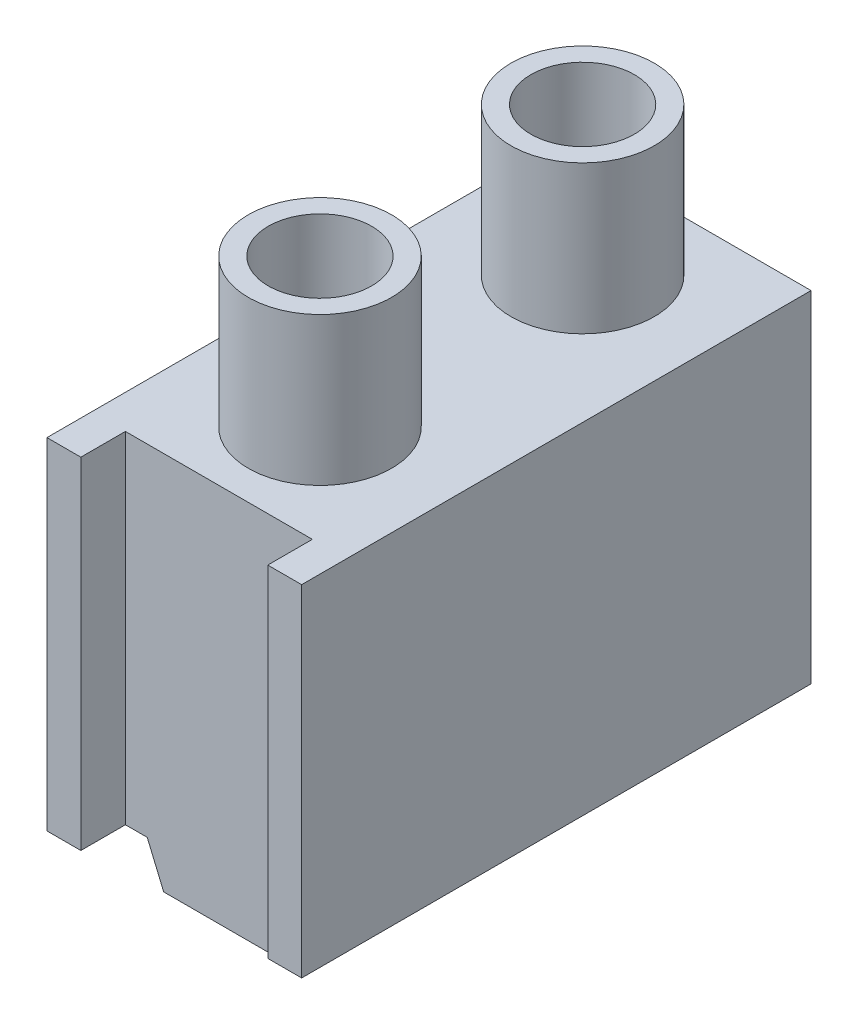
ISO-10303-21;
HEADER;
FILE_DESCRIPTION(('STEP AP214'),'2;1');
FILE_NAME('part.step','',(''),(''),'','','');
FILE_SCHEMA(('AUTOMOTIVE_DESIGN { 1 0 10303 214 1 1 1 1 }'));
ENDSEC;
DATA;
#1=APPLICATION_CONTEXT('core data for automotive mechanical design processes');
#2=APPLICATION_PROTOCOL_DEFINITION('international standard','automotive_design',2000,#1);
#3=PRODUCT_CONTEXT('',#1,'mechanical');
#4=PRODUCT('Part','Part','',(#3));
#5=PRODUCT_RELATED_PRODUCT_CATEGORY('part','',(#4));
#6=PRODUCT_DEFINITION_FORMATION('','',#4);
#7=PRODUCT_DEFINITION_CONTEXT('part definition',#1,'design');
#8=PRODUCT_DEFINITION('design','',#6,#7);
#9=PRODUCT_DEFINITION_SHAPE('','',#8);
#10=(LENGTH_UNIT() NAMED_UNIT(*) SI_UNIT(.MILLI.,.METRE.));
#11=(NAMED_UNIT(*) PLANE_ANGLE_UNIT() SI_UNIT($,.RADIAN.));
#12=(NAMED_UNIT(*) SI_UNIT($,.STERADIAN.) SOLID_ANGLE_UNIT());
#13=UNCERTAINTY_MEASURE_WITH_UNIT(LENGTH_MEASURE(1.E-05),#10,'distance_accuracy_value','');
#14=(GEOMETRIC_REPRESENTATION_CONTEXT(3) GLOBAL_UNCERTAINTY_ASSIGNED_CONTEXT((#13)) GLOBAL_UNIT_ASSIGNED_CONTEXT((#10,
#11,#12)) REPRESENTATION_CONTEXT('',''));
#15=CARTESIAN_POINT('',(0.,0.,0.));
#16=DIRECTION('',(0.,0.,1.));
#17=DIRECTION('',(1.,0.,0.));
#18=AXIS2_PLACEMENT_3D('',#15,#16,#17);
#19=CARTESIAN_POINT('',(0.,0.,32.));
#20=DIRECTION('',(0.,0.,1.));
#21=DIRECTION('',(1.,0.,0.));
#22=AXIS2_PLACEMENT_3D('',#19,#20,#21);
#23=PLANE('',#22);
#24=DIRECTION('',(0.,-1.,0.));
#25=VECTOR('',#24,1.);
#26=CARTESIAN_POINT('',(-13.87111125249,-113.2078554853,32.));
#27=LINE('',#26,#25);
#28=CARTESIAN_POINT('',(-13.87111125249,-113.2078554853,32.));
#29=VERTEX_POINT('',#28);
#30=CARTESIAN_POINT('',(-13.87111125249,-134.6078554853,32.));
#31=VERTEX_POINT('',#30);
#32=EDGE_CURVE('E25',#29,#31,#27,.T.);
#33=ORIENTED_EDGE('',*,*,#32,.F.);
#34=DIRECTION('',(-1.,0.,0.));
#35=VECTOR('',#34,1.);
#36=CARTESIAN_POINT('',(-13.87111125249,-113.2078554853,32.));
#37=LINE('',#36,#35);
#38=CARTESIAN_POINT('',(-16.,-113.2078554853,32.));
#39=VERTEX_POINT('',#38);
#40=EDGE_CURVE('E332',#29,#39,#37,.T.);
#41=ORIENTED_EDGE('',*,*,#40,.T.);
#42=DIRECTION('',(0.,-1.,0.));
#43=VECTOR('',#42,1.);
#44=CARTESIAN_POINT('',(-16.,-113.2078554853,32.));
#45=LINE('',#44,#43);
#46=CARTESIAN_POINT('',(-16.,-134.6078554853,32.));
#47=VERTEX_POINT('',#46);
#48=EDGE_CURVE('E37',#39,#47,#45,.T.);
#49=ORIENTED_EDGE('',*,*,#48,.T.);
#50=DIRECTION('',(1.,0.,0.));
#51=VECTOR('',#50,1.);
#52=CARTESIAN_POINT('',(-16.,-134.6078554853,32.));
#53=LINE('',#52,#51);
#54=EDGE_CURVE('E317',#47,#31,#53,.T.);
#55=ORIENTED_EDGE('',*,*,#54,.T.);
#56=EDGE_LOOP('',(#33,#41,#49,#55));
#57=FACE_BOUND('',#56,.T.);
#58=ADVANCED_FACE('F17',(#57),#23,.T.);
#59=CARTESIAN_POINT('',(0.,0.,32.));
#60=DIRECTION('',(0.,0.,1.));
#61=DIRECTION('',(1.,0.,0.));
#62=AXIS2_PLACEMENT_3D('',#59,#60,#61);
#63=PLANE('',#62);
#64=DIRECTION('',(0.,1.,0.));
#65=VECTOR('',#64,1.);
#66=CARTESIAN_POINT('',(-2.128888747504,-134.6078554853,32.));
#67=LINE('',#66,#65);
#68=CARTESIAN_POINT('',(-2.128888747504,-134.6078554853,32.));
#69=VERTEX_POINT('',#68);
#70=CARTESIAN_POINT('',(-2.128888747504,-113.2078554853,32.));
#71=VERTEX_POINT('',#70);
#72=EDGE_CURVE('E11',#69,#71,#67,.T.);
#73=ORIENTED_EDGE('',*,*,#72,.F.);
#74=DIRECTION('',(1.,0.,0.));
#75=VECTOR('',#74,1.);
#76=CARTESIAN_POINT('',(-2.128888747504,-134.6078554853,32.));
#77=LINE('',#76,#75);
#78=CARTESIAN_POINT('',(0.,-134.6078554853,32.));
#79=VERTEX_POINT('',#78);
#80=EDGE_CURVE('E348',#69,#79,#77,.T.);
#81=ORIENTED_EDGE('',*,*,#80,.T.);
#82=DIRECTION('',(0.,1.,0.));
#83=VECTOR('',#82,1.);
#84=CARTESIAN_POINT('',(0.,-134.6078554853,32.));
#85=LINE('',#84,#83);
#86=CARTESIAN_POINT('',(0.,-113.2078554853,32.));
#87=VERTEX_POINT('',#86);
#88=EDGE_CURVE('E338',#79,#87,#85,.T.);
#89=ORIENTED_EDGE('',*,*,#88,.T.);
#90=DIRECTION('',(-1.,0.,0.));
#91=VECTOR('',#90,1.);
#92=CARTESIAN_POINT('',(0.,-113.2078554853,32.));
#93=LINE('',#92,#91);
#94=EDGE_CURVE('E320',#87,#71,#93,.T.);
#95=ORIENTED_EDGE('',*,*,#94,.T.);
#96=EDGE_LOOP('',(#73,#81,#89,#95));
#97=FACE_BOUND('',#96,.T.);
#98=ADVANCED_FACE('F518',(#97),#63,.T.);
#99=CARTESIAN_POINT('',(-2.128888747504,-143.2078554853,32.));
#100=DIRECTION('',(1.,0.,0.));
#101=DIRECTION('',(0.,1.,0.));
#102=AXIS2_PLACEMENT_3D('',#99,#100,#101);
#103=PLANE('',#102);
#104=DIRECTION('',(0.,0.,-1.));
#105=VECTOR('',#104,1.);
#106=CARTESIAN_POINT('',(-2.128888747504,-113.2078554853,32.));
#107=LINE('',#106,#105);
#108=CARTESIAN_POINT('',(-2.128888747504,-113.2078554853,29.2));
#109=VERTEX_POINT('',#108);
#110=EDGE_CURVE('E225',#71,#109,#107,.T.);
#111=ORIENTED_EDGE('',*,*,#110,.T.);
#112=DIRECTION('',(0.,1.,0.));
#113=VECTOR('',#112,1.);
#114=CARTESIAN_POINT('',(-2.128888747504,-134.6078554853,29.2));
#115=LINE('',#114,#113);
#116=CARTESIAN_POINT('',(-2.128888747504,-134.6078554853,29.2));
#117=VERTEX_POINT('',#116);
#118=EDGE_CURVE('E226',#117,#109,#115,.T.);
#119=ORIENTED_EDGE('',*,*,#118,.F.);
#120=DIRECTION('',(0.,0.,1.));
#121=VECTOR('',#120,1.);
#122=CARTESIAN_POINT('',(-2.128888747504,-134.6078554853,29.2));
#123=LINE('',#122,#121);
#124=EDGE_CURVE('E351',#117,#69,#123,.T.);
#125=ORIENTED_EDGE('',*,*,#124,.T.);
#126=ORIENTED_EDGE('',*,*,#72,.T.);
#127=EDGE_LOOP('',(#111,#119,#125,#126));
#128=FACE_BOUND('',#127,.T.);
#129=ADVANCED_FACE('F510',(#128),#103,.F.);
#130=CARTESIAN_POINT('',(-13.87111125249,-143.2078554853,29.2));
#131=DIRECTION('',(-1.,0.,0.));
#132=DIRECTION('',(0.,0.,1.));
#133=AXIS2_PLACEMENT_3D('',#130,#131,#132);
#134=PLANE('',#133);
#135=DIRECTION('',(0.,0.,1.));
#136=VECTOR('',#135,1.);
#137=CARTESIAN_POINT('',(-13.87111125249,-113.2078554853,29.2));
#138=LINE('',#137,#136);
#139=CARTESIAN_POINT('',(-13.87111125249,-113.2078554853,29.2));
#140=VERTEX_POINT('',#139);
#141=EDGE_CURVE('E335',#140,#29,#138,.T.);
#142=ORIENTED_EDGE('',*,*,#141,.T.);
#143=ORIENTED_EDGE('',*,*,#32,.T.);
#144=DIRECTION('',(0.,0.,-1.));
#145=VECTOR('',#144,1.);
#146=CARTESIAN_POINT('',(-13.87111125249,-134.6078554853,32.));
#147=LINE('',#146,#145);
#148=CARTESIAN_POINT('',(-13.87111125249,-134.6078554853,29.2));
#149=VERTEX_POINT('',#148);
#150=EDGE_CURVE('E344',#31,#149,#147,.T.);
#151=ORIENTED_EDGE('',*,*,#150,.T.);
#152=DIRECTION('',(0.,1.,0.));
#153=VECTOR('',#152,1.);
#154=CARTESIAN_POINT('',(-13.87111125249,-134.6078554853,29.2));
#155=LINE('',#154,#153);
#156=EDGE_CURVE('E232',#149,#140,#155,.T.);
#157=ORIENTED_EDGE('',*,*,#156,.T.);
#158=EDGE_LOOP('',(#142,#143,#151,#157));
#159=FACE_BOUND('',#158,.T.);
#160=ADVANCED_FACE('F478',(#159),#134,.F.);
#161=CARTESIAN_POINT('',(-16.,-113.2078554853,0.));
#162=DIRECTION('',(-1.,0.,0.));
#163=DIRECTION('',(0.,0.,1.));
#164=AXIS2_PLACEMENT_3D('',#161,#162,#163);
#165=PLANE('',#164);
#166=DIRECTION('',(0.,-1.,0.));
#167=VECTOR('',#166,1.);
#168=CARTESIAN_POINT('',(-16.,-113.2078554853,0.));
#169=LINE('',#168,#167);
#170=CARTESIAN_POINT('',(-16.,-113.2078554853,0.));
#171=VERTEX_POINT('',#170);
#172=CARTESIAN_POINT('',(-16.,-134.6078554853,0.));
#173=VERTEX_POINT('',#172);
#174=EDGE_CURVE('E283',#171,#173,#169,.T.);
#175=ORIENTED_EDGE('',*,*,#174,.T.);
#176=DIRECTION('',(0.,0.,1.));
#177=VECTOR('',#176,1.);
#178=CARTESIAN_POINT('',(-16.,-134.6078554853,0.));
#179=LINE('',#178,#177);
#180=EDGE_CURVE('E188',#173,#47,#179,.T.);
#181=ORIENTED_EDGE('',*,*,#180,.T.);
#182=ORIENTED_EDGE('',*,*,#48,.F.);
#183=DIRECTION('',(0.,0.,1.));
#184=VECTOR('',#183,1.);
#185=CARTESIAN_POINT('',(-16.,-113.2078554853,0.));
#186=LINE('',#185,#184);
#187=EDGE_CURVE('E328',#171,#39,#186,.T.);
#188=ORIENTED_EDGE('',*,*,#187,.F.);
#189=EDGE_LOOP('',(#175,#181,#182,#188));
#190=FACE_BOUND('',#189,.T.);
#191=ADVANCED_FACE('F392',(#190),#165,.T.);
#192=CARTESIAN_POINT('',(-16.,-134.6078554853,0.));
#193=DIRECTION('',(0.,-1.,0.));
#194=DIRECTION('',(0.,0.,-1.));
#195=AXIS2_PLACEMENT_3D('',#192,#193,#194);
#196=PLANE('',#195);
#197=DIRECTION('',(0.,0.,-1.));
#198=VECTOR('',#197,1.);
#199=CARTESIAN_POINT('',(-12.50098616425,-134.6078554853,29.2));
#200=LINE('',#199,#198);
#201=CARTESIAN_POINT('',(-12.50098616425,-134.6078554853,29.2));
#202=VERTEX_POINT('',#201);
#203=CARTESIAN_POINT('',(-12.50098616425,-134.6078554853,0.));
#204=VERTEX_POINT('',#203);
#205=EDGE_CURVE('E222',#202,#204,#200,.T.);
#206=ORIENTED_EDGE('',*,*,#205,.F.);
#207=DIRECTION('',(1.,0.,0.));
#208=VECTOR('',#207,1.);
#209=CARTESIAN_POINT('',(-13.87111125249,-134.6078554853,29.2));
#210=LINE('',#209,#208);
#211=EDGE_CURVE('E227',#149,#202,#210,.T.);
#212=ORIENTED_EDGE('',*,*,#211,.F.);
#213=ORIENTED_EDGE('',*,*,#150,.F.);
#214=ORIENTED_EDGE('',*,*,#54,.F.);
#215=ORIENTED_EDGE('',*,*,#180,.F.);
#216=DIRECTION('',(1.,0.,0.));
#217=VECTOR('',#216,1.);
#218=CARTESIAN_POINT('',(-16.,-134.6078554853,0.));
#219=LINE('',#218,#217);
#220=EDGE_CURVE('E279',#173,#204,#219,.T.);
#221=ORIENTED_EDGE('',*,*,#220,.T.);
#222=EDGE_LOOP('',(#206,#212,#213,#214,#215,#221));
#223=FACE_BOUND('',#222,.T.);
#224=ADVANCED_FACE('F386',(#223),#196,.T.);
#225=CARTESIAN_POINT('',(-16.,-134.6078554853,0.));
#226=DIRECTION('',(0.,-1.,0.));
#227=DIRECTION('',(0.,0.,-1.));
#228=AXIS2_PLACEMENT_3D('',#225,#226,#227);
#229=PLANE('',#228);
#230=DIRECTION('',(0.,0.,1.));
#231=VECTOR('',#230,1.);
#232=CARTESIAN_POINT('',(-3.499013835749,-134.6078554853,0.));
#233=LINE('',#232,#231);
#234=CARTESIAN_POINT('',(-3.499013835749,-134.6078554853,0.));
#235=VERTEX_POINT('',#234);
#236=CARTESIAN_POINT('',(-3.499013835749,-134.6078554853,29.2));
#237=VERTEX_POINT('',#236);
#238=EDGE_CURVE('E295',#235,#237,#233,.T.);
#239=ORIENTED_EDGE('',*,*,#238,.F.);
#240=DIRECTION('',(1.,0.,0.));
#241=VECTOR('',#240,1.);
#242=CARTESIAN_POINT('',(-3.499013835749,-134.6078554853,0.));
#243=LINE('',#242,#241);
#244=CARTESIAN_POINT('',(0.,-134.6078554853,0.));
#245=VERTEX_POINT('',#244);
#246=EDGE_CURVE('E261',#235,#245,#243,.T.);
#247=ORIENTED_EDGE('',*,*,#246,.T.);
#248=DIRECTION('',(0.,0.,1.));
#249=VECTOR('',#248,1.);
#250=CARTESIAN_POINT('',(0.,-134.6078554853,0.));
#251=LINE('',#250,#249);
#252=EDGE_CURVE('E341',#245,#79,#251,.T.);
#253=ORIENTED_EDGE('',*,*,#252,.T.);
#254=ORIENTED_EDGE('',*,*,#80,.F.);
#255=ORIENTED_EDGE('',*,*,#124,.F.);
#256=DIRECTION('',(1.,0.,0.));
#257=VECTOR('',#256,1.);
#258=CARTESIAN_POINT('',(-3.499013835749,-134.6078554853,29.2));
#259=LINE('',#258,#257);
#260=EDGE_CURVE('E308',#237,#117,#259,.T.);
#261=ORIENTED_EDGE('',*,*,#260,.F.);
#262=EDGE_LOOP('',(#239,#247,#253,#254,#255,#261));
#263=FACE_BOUND('',#262,.T.);
#264=ADVANCED_FACE('F391',(#263),#229,.T.);
#265=CARTESIAN_POINT('',(0.,-134.6078554853,0.));
#266=DIRECTION('',(1.,0.,0.));
#267=DIRECTION('',(0.,-1.,0.));
#268=AXIS2_PLACEMENT_3D('',#265,#266,#267);
#269=PLANE('',#268);
#270=DIRECTION('',(0.,1.,0.));
#271=VECTOR('',#270,1.);
#272=CARTESIAN_POINT('',(0.,-134.6078554853,0.));
#273=LINE('',#272,#271);
#274=CARTESIAN_POINT('',(0.,-113.2078554853,0.));
#275=VERTEX_POINT('',#274);
#276=EDGE_CURVE('E254',#245,#275,#273,.T.);
#277=ORIENTED_EDGE('',*,*,#276,.T.);
#278=DIRECTION('',(0.,0.,1.));
#279=VECTOR('',#278,1.);
#280=CARTESIAN_POINT('',(0.,-113.2078554853,0.));
#281=LINE('',#280,#279);
#282=EDGE_CURVE('E324',#275,#87,#281,.T.);
#283=ORIENTED_EDGE('',*,*,#282,.T.);
#284=ORIENTED_EDGE('',*,*,#88,.F.);
#285=ORIENTED_EDGE('',*,*,#252,.F.);
#286=EDGE_LOOP('',(#277,#283,#284,#285));
#287=FACE_BOUND('',#286,.T.);
#288=ADVANCED_FACE('F484',(#287),#269,.T.);
#289=CARTESIAN_POINT('',(0.,-113.2078554853,0.));
#290=DIRECTION('',(0.,1.,0.));
#291=DIRECTION('',(1.,0.,0.));
#292=AXIS2_PLACEMENT_3D('',#289,#290,#291);
#293=PLANE('',#292);
#294=CARTESIAN_POINT('',(-8.,-113.2078554853,22.85));
#295=DIRECTION('',(0.,1.,0.));
#296=DIRECTION('',(-1.,0.,0.));
#297=AXIS2_PLACEMENT_3D('',#294,#295,#296);
#298=CIRCLE('',#297,4.5);
#299=CARTESIAN_POINT('',(-12.5,-113.2078554853,22.85));
#300=VERTEX_POINT('',#299);
#301=EDGE_CURVE('E171',#300,#300,#298,.T.);
#302=ORIENTED_EDGE('',*,*,#301,.F.);
#303=EDGE_LOOP('',(#302));
#304=FACE_BOUND('',#303,.T.);
#305=CARTESIAN_POINT('',(-8.,-113.2078554853,6.35));
#306=DIRECTION('',(0.,1.,0.));
#307=DIRECTION('',(-1.,0.,0.));
#308=AXIS2_PLACEMENT_3D('',#305,#306,#307);
#309=CIRCLE('',#308,4.5);
#310=CARTESIAN_POINT('',(-12.5,-113.2078554853,6.35));
#311=VERTEX_POINT('',#310);
#312=EDGE_CURVE('E248',#311,#311,#309,.T.);
#313=ORIENTED_EDGE('',*,*,#312,.F.);
#314=EDGE_LOOP('',(#313));
#315=FACE_BOUND('',#314,.T.);
#316=ORIENTED_EDGE('',*,*,#110,.F.);
#317=ORIENTED_EDGE('',*,*,#94,.F.);
#318=ORIENTED_EDGE('',*,*,#282,.F.);
#319=DIRECTION('',(-1.,0.,0.));
#320=VECTOR('',#319,1.);
#321=CARTESIAN_POINT('',(0.,-113.2078554853,0.));
#322=LINE('',#321,#320);
#323=EDGE_CURVE('E291',#275,#171,#322,.T.);
#324=ORIENTED_EDGE('',*,*,#323,.T.);
#325=ORIENTED_EDGE('',*,*,#187,.T.);
#326=ORIENTED_EDGE('',*,*,#40,.F.);
#327=ORIENTED_EDGE('',*,*,#141,.F.);
#328=DIRECTION('',(-1.,0.,0.));
#329=VECTOR('',#328,1.);
#330=CARTESIAN_POINT('',(-2.128888747504,-113.2078554853,29.2));
#331=LINE('',#330,#329);
#332=EDGE_CURVE('E287',#109,#140,#331,.T.);
#333=ORIENTED_EDGE('',*,*,#332,.F.);
#334=EDGE_LOOP('',(#316,#317,#318,#324,#325,#326,#327,#333));
#335=FACE_BOUND('',#334,.T.);
#336=ADVANCED_FACE('F469',(#304,#315,#335),#293,.T.);
#337=CARTESIAN_POINT('',(-12.50098616425,-134.6078554853,-1.));
#338=DIRECTION('',(-0.921115827107869,-0.389288624353945,0.));
#339=DIRECTION('',(-0.389288624353945,0.921115827107869,0.));
#340=AXIS2_PLACEMENT_3D('',#337,#338,#339);
#341=PLANE('',#340);
#342=ORIENTED_EDGE('',*,*,#205,.T.);
#343=DIRECTION('',(0.389288624353945,-0.921115827107869,0.));
#344=VECTOR('',#343,1.);
#345=CARTESIAN_POINT('',(-12.50098616425,-134.6078554853,0.));
#346=LINE('',#345,#344);
#347=CARTESIAN_POINT('',(-11.46554946715,-137.0578554853,0.));
#348=VERTEX_POINT('',#347);
#349=EDGE_CURVE('E260',#204,#348,#346,.T.);
#350=ORIENTED_EDGE('',*,*,#349,.T.);
#351=DIRECTION('',(0.,0.,1.));
#352=VECTOR('',#351,1.);
#353=CARTESIAN_POINT('',(-11.46554946715,-137.0578554853,0.));
#354=LINE('',#353,#352);
#355=CARTESIAN_POINT('',(-11.46554946715,-137.0578554853,29.2));
#356=VERTEX_POINT('',#355);
#357=EDGE_CURVE('E209',#348,#356,#354,.T.);
#358=ORIENTED_EDGE('',*,*,#357,.T.);
#359=DIRECTION('',(0.389288624353945,-0.921115827107869,0.));
#360=VECTOR('',#359,1.);
#361=CARTESIAN_POINT('',(-12.50098616425,-134.6078554853,29.2));
#362=LINE('',#361,#360);
#363=EDGE_CURVE('E231',#202,#356,#362,.T.);
#364=ORIENTED_EDGE('',*,*,#363,.F.);
#365=EDGE_LOOP('',(#342,#350,#358,#364));
#366=FACE_BOUND('',#365,.T.);
#367=ADVANCED_FACE('F460',(#366),#341,.T.);
#368=CARTESIAN_POINT('',(-2.128888747504,-143.2078554853,29.2));
#369=DIRECTION('',(0.,0.,-1.));
#370=DIRECTION('',(0.,-1.,0.));
#371=AXIS2_PLACEMENT_3D('',#368,#369,#370);
#372=PLANE('',#371);
#373=ORIENTED_EDGE('',*,*,#332,.T.);
#374=ORIENTED_EDGE('',*,*,#156,.F.);
#375=ORIENTED_EDGE('',*,*,#211,.T.);
#376=ORIENTED_EDGE('',*,*,#363,.T.);
#377=DIRECTION('',(1.,0.,0.));
#378=VECTOR('',#377,1.);
#379=CARTESIAN_POINT('',(-11.46554946715,-137.0578554853,29.2));
#380=LINE('',#379,#378);
#381=CARTESIAN_POINT('',(-4.53445053285,-137.0578554853,29.2));
#382=VERTEX_POINT('',#381);
#383=EDGE_CURVE('E221',#356,#382,#380,.T.);
#384=ORIENTED_EDGE('',*,*,#383,.T.);
#385=DIRECTION('',(0.389288624353945,0.921115827107869,0.));
#386=VECTOR('',#385,1.);
#387=CARTESIAN_POINT('',(-4.53445053285,-137.0578554853,29.2));
#388=LINE('',#387,#386);
#389=EDGE_CURVE('E299',#382,#237,#388,.T.);
#390=ORIENTED_EDGE('',*,*,#389,.T.);
#391=ORIENTED_EDGE('',*,*,#260,.T.);
#392=ORIENTED_EDGE('',*,*,#118,.T.);
#393=EDGE_LOOP('',(#373,#374,#375,#376,#384,#390,#391,#392));
#394=FACE_BOUND('',#393,.T.);
#395=ADVANCED_FACE('F451',(#394),#372,.F.);
#396=CARTESIAN_POINT('',(-4.53445053285,-137.0578554853,-1.));
#397=DIRECTION('',(0.921115827107869,-0.389288624353945,0.));
#398=DIRECTION('',(0.,0.,-1.));
#399=AXIS2_PLACEMENT_3D('',#396,#397,#398);
#400=PLANE('',#399);
#401=ORIENTED_EDGE('',*,*,#238,.T.);
#402=ORIENTED_EDGE('',*,*,#389,.F.);
#403=DIRECTION('',(0.,0.,1.));
#404=VECTOR('',#403,1.);
#405=CARTESIAN_POINT('',(-4.53445053285,-137.0578554853,0.));
#406=LINE('',#405,#404);
#407=CARTESIAN_POINT('',(-4.53445053285,-137.0578554853,0.));
#408=VERTEX_POINT('',#407);
#409=EDGE_CURVE('E217',#408,#382,#406,.T.);
#410=ORIENTED_EDGE('',*,*,#409,.F.);
#411=DIRECTION('',(0.389288624353945,0.921115827107869,0.));
#412=VECTOR('',#411,1.);
#413=CARTESIAN_POINT('',(-4.53445053285,-137.0578554853,0.));
#414=LINE('',#413,#412);
#415=EDGE_CURVE('E256',#408,#235,#414,.T.);
#416=ORIENTED_EDGE('',*,*,#415,.T.);
#417=EDGE_LOOP('',(#401,#402,#410,#416));
#418=FACE_BOUND('',#417,.T.);
#419=ADVANCED_FACE('F442',(#418),#400,.T.);
#420=CARTESIAN_POINT('',(0.,0.,0.));
#421=DIRECTION('',(0.,0.,1.));
#422=DIRECTION('',(1.,0.,0.));
#423=AXIS2_PLACEMENT_3D('',#420,#421,#422);
#424=PLANE('',#423);
#425=ORIENTED_EDGE('',*,*,#276,.F.);
#426=ORIENTED_EDGE('',*,*,#246,.F.);
#427=ORIENTED_EDGE('',*,*,#415,.F.);
#428=DIRECTION('',(1.,0.,0.));
#429=VECTOR('',#428,1.);
#430=CARTESIAN_POINT('',(-11.46554946715,-137.0578554853,0.));
#431=LINE('',#430,#429);
#432=EDGE_CURVE('E213',#348,#408,#431,.T.);
#433=ORIENTED_EDGE('',*,*,#432,.F.);
#434=ORIENTED_EDGE('',*,*,#349,.F.);
#435=ORIENTED_EDGE('',*,*,#220,.F.);
#436=ORIENTED_EDGE('',*,*,#174,.F.);
#437=ORIENTED_EDGE('',*,*,#323,.F.);
#438=EDGE_LOOP('',(#425,#426,#427,#433,#434,#435,#436,#437));
#439=FACE_BOUND('',#438,.T.);
#440=ADVANCED_FACE('F379',(#439),#424,.F.);
#441=CARTESIAN_POINT('',(-8.,-113.2078554853,6.35));
#442=DIRECTION('',(0.,1.,0.));
#443=DIRECTION('',(-1.,0.,0.));
#444=AXIS2_PLACEMENT_3D('',#441,#442,#443);
#445=CYLINDRICAL_SURFACE('',#444,4.5);
#446=CARTESIAN_POINT('',(-8.,-103.9078554853,6.35));
#447=DIRECTION('',(0.,1.,0.));
#448=DIRECTION('',(-1.,0.,0.));
#449=AXIS2_PLACEMENT_3D('',#446,#447,#448);
#450=CIRCLE('',#449,4.5);
#451=CARTESIAN_POINT('',(-12.5,-103.9078554853,6.35));
#452=VERTEX_POINT('',#451);
#453=EDGE_CURVE('E184',#452,#452,#450,.T.);
#454=ORIENTED_EDGE('',*,*,#453,.F.);
#455=CARTESIAN_POINT('',(-12.5,-113.2078554853,6.35));
#456=CARTESIAN_POINT('',(-12.5,-103.9078554853,6.35));
#457=(BOUNDED_CURVE() B_SPLINE_CURVE(1,(#455,#456),.UNSPECIFIED.,.F.,
.F.) B_SPLINE_CURVE_WITH_KNOTS((2,2),(0.,9.3),
.UNSPECIFIED.) CURVE() GEOMETRIC_REPRESENTATION_ITEM() RATIONAL_B_SPLINE_CURVE((1.,1.)) REPRESENTATION_ITEM(''));
#458=EDGE_CURVE('E255',#311,#452,#457,.T.);
#459=ORIENTED_EDGE('',*,*,#458,.F.);
#460=ORIENTED_EDGE('',*,*,#312,.T.);
#461=ORIENTED_EDGE('',*,*,#458,.T.);
#462=EDGE_LOOP('',(#454,#459,#460,#461));
#463=FACE_BOUND('',#462,.T.);
#464=ADVANCED_FACE('F374',(#463),#445,.T.);
#465=CARTESIAN_POINT('',(-8.,-113.2078554853,22.85));
#466=DIRECTION('',(0.,1.,0.));
#467=DIRECTION('',(-1.,0.,0.));
#468=AXIS2_PLACEMENT_3D('',#465,#466,#467);
#469=CYLINDRICAL_SURFACE('',#468,4.5);
#470=CARTESIAN_POINT('',(-8.,-103.9078554853,22.85));
#471=DIRECTION('',(0.,1.,0.));
#472=DIRECTION('',(-1.,0.,0.));
#473=AXIS2_PLACEMENT_3D('',#470,#471,#472);
#474=CIRCLE('',#473,4.5);
#475=CARTESIAN_POINT('',(-12.5,-103.9078554853,22.85));
#476=VERTEX_POINT('',#475);
#477=EDGE_CURVE('E169',#476,#476,#474,.T.);
#478=ORIENTED_EDGE('',*,*,#477,.F.);
#479=CARTESIAN_POINT('',(-12.5,-113.2078554853,22.85));
#480=CARTESIAN_POINT('',(-12.5,-103.9078554853,22.85));
#481=(BOUNDED_CURVE() B_SPLINE_CURVE(1,(#479,#480),.UNSPECIFIED.,.F.,
.F.) B_SPLINE_CURVE_WITH_KNOTS((2,2),(0.,9.3),
.UNSPECIFIED.) CURVE() GEOMETRIC_REPRESENTATION_ITEM() RATIONAL_B_SPLINE_CURVE((1.,1.)) REPRESENTATION_ITEM(''));
#482=EDGE_CURVE('E166',#300,#476,#481,.T.);
#483=ORIENTED_EDGE('',*,*,#482,.F.);
#484=ORIENTED_EDGE('',*,*,#301,.T.);
#485=ORIENTED_EDGE('',*,*,#482,.T.);
#486=EDGE_LOOP('',(#478,#483,#484,#485));
#487=FACE_BOUND('',#486,.T.);
#488=ADVANCED_FACE('F168',(#487),#469,.T.);
#489=CARTESIAN_POINT('',(-8.,-137.9078554853,22.85));
#490=DIRECTION('',(0.,1.,0.));
#491=DIRECTION('',(-1.,0.,0.));
#492=AXIS2_PLACEMENT_3D('',#489,#490,#491);
#493=CYLINDRICAL_SURFACE('',#492,3.25);
#494=CARTESIAN_POINT('',(-11.25,-137.0578554853,22.85));
#495=CARTESIAN_POINT('',(-11.25,-103.9078554853,22.85));
#496=(BOUNDED_CURVE() B_SPLINE_CURVE(1,(#494,#495),.UNSPECIFIED.,.F.,
.F.) B_SPLINE_CURVE_WITH_KNOTS((2,2),(0.85,34.),
.UNSPECIFIED.) CURVE() GEOMETRIC_REPRESENTATION_ITEM() RATIONAL_B_SPLINE_CURVE((1.,1.)) REPRESENTATION_ITEM(''));
#497=CARTESIAN_POINT('',(-11.25,-137.0578554853,22.85));
#498=VERTEX_POINT('',#497);
#499=CARTESIAN_POINT('',(-11.25,-103.9078554853,22.85));
#500=VERTEX_POINT('',#499);
#501=EDGE_CURVE('E173',#498,#500,#496,.T.);
#502=ORIENTED_EDGE('',*,*,#501,.F.);
#503=CARTESIAN_POINT('',(-8.,-137.0578554853,22.85));
#504=DIRECTION('',(0.,1.,0.));
#505=DIRECTION('',(-1.,0.,0.));
#506=AXIS2_PLACEMENT_3D('',#503,#504,#505);
#507=CIRCLE('',#506,3.25);
#508=EDGE_CURVE('E200',#498,#498,#507,.T.);
#509=ORIENTED_EDGE('',*,*,#508,.F.);
#510=ORIENTED_EDGE('',*,*,#501,.T.);
#511=CARTESIAN_POINT('',(-8.,-103.9078554853,22.85));
#512=DIRECTION('',(0.,1.,0.));
#513=DIRECTION('',(-1.,0.,0.));
#514=AXIS2_PLACEMENT_3D('',#511,#512,#513);
#515=CIRCLE('',#514,3.25);
#516=EDGE_CURVE('E178',#500,#500,#515,.T.);
#517=ORIENTED_EDGE('',*,*,#516,.T.);
#518=EDGE_LOOP('',(#502,#509,#510,#517));
#519=FACE_BOUND('',#518,.T.);
#520=ADVANCED_FACE('F408',(#519),#493,.F.);
#521=CARTESIAN_POINT('',(-8.,-137.9078554853,6.35));
#522=DIRECTION('',(0.,1.,0.));
#523=DIRECTION('',(-1.,0.,0.));
#524=AXIS2_PLACEMENT_3D('',#521,#522,#523);
#525=CYLINDRICAL_SURFACE('',#524,3.25);
#526=CARTESIAN_POINT('',(-11.25,-137.0578554853,6.35));
#527=CARTESIAN_POINT('',(-11.25,-103.9078554853,6.35));
#528=(BOUNDED_CURVE() B_SPLINE_CURVE(1,(#526,#527),.UNSPECIFIED.,.F.,
.F.) B_SPLINE_CURVE_WITH_KNOTS((2,2),(0.85,34.),
.UNSPECIFIED.) CURVE() GEOMETRIC_REPRESENTATION_ITEM() RATIONAL_B_SPLINE_CURVE((1.,1.)) REPRESENTATION_ITEM(''));
#529=CARTESIAN_POINT('',(-11.25,-137.0578554853,6.35));
#530=VERTEX_POINT('',#529);
#531=CARTESIAN_POINT('',(-11.25,-103.9078554853,6.35));
#532=VERTEX_POINT('',#531);
#533=EDGE_CURVE('E193',#530,#532,#528,.T.);
#534=ORIENTED_EDGE('',*,*,#533,.F.);
#535=CARTESIAN_POINT('',(-8.,-137.0578554853,6.35));
#536=DIRECTION('',(0.,1.,0.));
#537=DIRECTION('',(-1.,0.,0.));
#538=AXIS2_PLACEMENT_3D('',#535,#536,#537);
#539=CIRCLE('',#538,3.25);
#540=EDGE_CURVE('E194',#530,#530,#539,.T.);
#541=ORIENTED_EDGE('',*,*,#540,.F.);
#542=ORIENTED_EDGE('',*,*,#533,.T.);
#543=CARTESIAN_POINT('',(-8.,-103.9078554853,6.35));
#544=DIRECTION('',(0.,1.,0.));
#545=DIRECTION('',(-1.,0.,0.));
#546=AXIS2_PLACEMENT_3D('',#543,#544,#545);
#547=CIRCLE('',#546,3.25);
#548=EDGE_CURVE('E205',#532,#532,#547,.T.);
#549=ORIENTED_EDGE('',*,*,#548,.T.);
#550=EDGE_LOOP('',(#534,#541,#542,#549));
#551=FACE_BOUND('',#550,.T.);
#552=ADVANCED_FACE('F413',(#551),#525,.F.);
#553=CARTESIAN_POINT('',(-11.46554946715,-137.0578554853,-1.));
#554=DIRECTION('',(0.,-1.,0.));
#555=DIRECTION('',(0.,0.,-1.));
#556=AXIS2_PLACEMENT_3D('',#553,#554,#555);
#557=PLANE('',#556);
#558=ORIENTED_EDGE('',*,*,#540,.T.);
#559=EDGE_LOOP('',(#558));
#560=FACE_BOUND('',#559,.T.);
#561=ORIENTED_EDGE('',*,*,#508,.T.);
#562=EDGE_LOOP('',(#561));
#563=FACE_BOUND('',#562,.T.);
#564=ORIENTED_EDGE('',*,*,#432,.T.);
#565=ORIENTED_EDGE('',*,*,#409,.T.);
#566=ORIENTED_EDGE('',*,*,#383,.F.);
#567=ORIENTED_EDGE('',*,*,#357,.F.);
#568=EDGE_LOOP('',(#564,#565,#566,#567));
#569=FACE_BOUND('',#568,.T.);
#570=ADVANCED_FACE('F402',(#560,#563,#569),#557,.T.);
#571=CARTESIAN_POINT('',(0.,-103.9078554853,0.));
#572=DIRECTION('',(0.,1.,0.));
#573=DIRECTION('',(1.,0.,0.));
#574=AXIS2_PLACEMENT_3D('',#571,#572,#573);
#575=PLANE('',#574);
#576=ORIENTED_EDGE('',*,*,#548,.F.);
#577=EDGE_LOOP('',(#576));
#578=FACE_BOUND('',#577,.T.);
#579=ORIENTED_EDGE('',*,*,#453,.T.);
#580=EDGE_LOOP('',(#579));
#581=FACE_BOUND('',#580,.T.);
#582=ADVANCED_FACE('F367',(#578,#581),#575,.T.);
#583=CARTESIAN_POINT('',(0.,-103.9078554853,0.));
#584=DIRECTION('',(0.,1.,0.));
#585=DIRECTION('',(1.,0.,0.));
#586=AXIS2_PLACEMENT_3D('',#583,#584,#585);
#587=PLANE('',#586);
#588=ORIENTED_EDGE('',*,*,#516,.F.);
#589=EDGE_LOOP('',(#588));
#590=FACE_BOUND('',#589,.T.);
#591=ORIENTED_EDGE('',*,*,#477,.T.);
#592=EDGE_LOOP('',(#591));
#593=FACE_BOUND('',#592,.T.);
#594=ADVANCED_FACE('F176',(#590,#593),#587,.T.);
#595=CLOSED_SHELL('',(#58,#98,#129,#160,#191,#224,#264,#288,#336,#367,#395,#419,#440,#464,#488,
#520,#552,#570,#582,#594));
#596=MANIFOLD_SOLID_BREP('B1',#595);
#597=ADVANCED_BREP_SHAPE_REPRESENTATION('',(#18,#596),#14);
#598=SHAPE_DEFINITION_REPRESENTATION(#9,#597);
ENDSEC;
END-ISO-10303-21;
